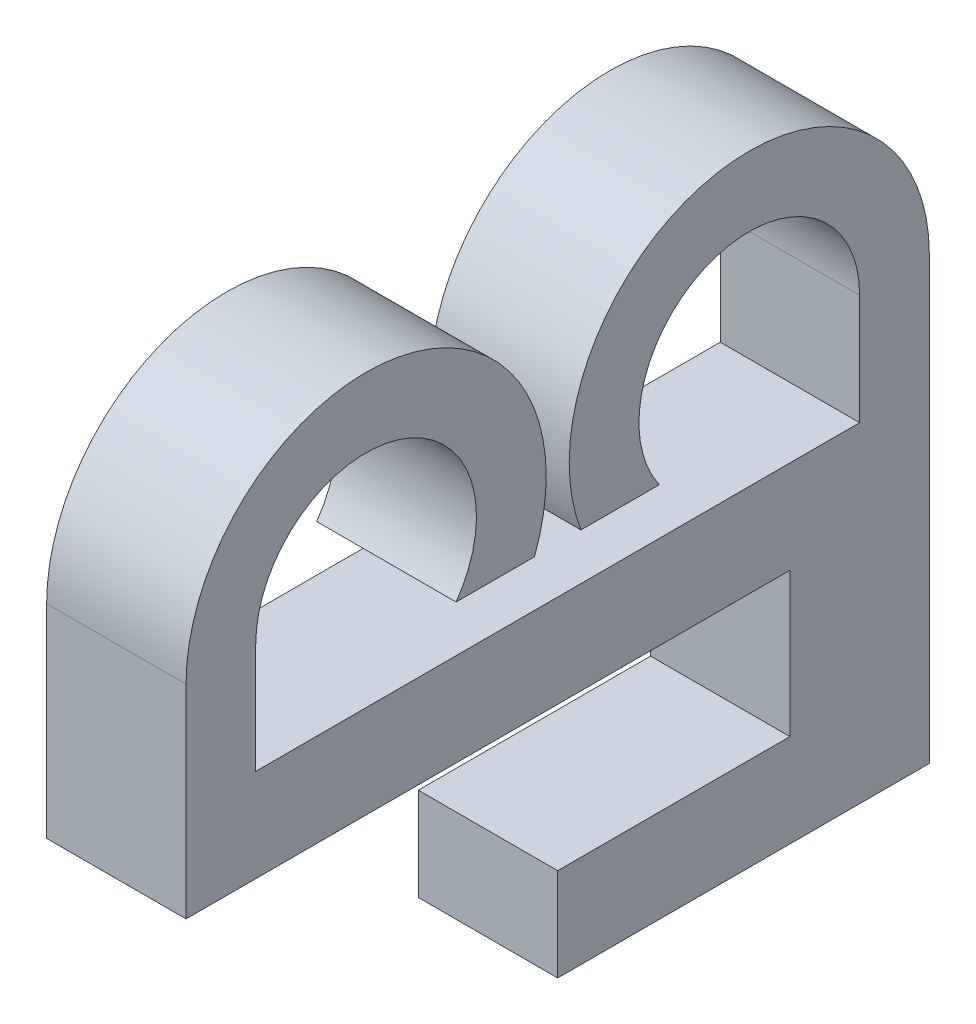
ISO-10303-21;
HEADER;
FILE_DESCRIPTION(('STEP AP214'),'2;1');
FILE_NAME('part.step','',(''),(''),'','','');
FILE_SCHEMA(('AUTOMOTIVE_DESIGN { 1 0 10303 214 1 1 1 1 }'));
ENDSEC;
DATA;
#1=APPLICATION_CONTEXT('core data for automotive mechanical design processes');
#2=APPLICATION_PROTOCOL_DEFINITION('international standard','automotive_design',2000,#1);
#3=PRODUCT_CONTEXT('',#1,'mechanical');
#4=PRODUCT('Part','Part','',(#3));
#5=PRODUCT_RELATED_PRODUCT_CATEGORY('part','',(#4));
#6=PRODUCT_DEFINITION_FORMATION('','',#4);
#7=PRODUCT_DEFINITION_CONTEXT('part definition',#1,'design');
#8=PRODUCT_DEFINITION('design','',#6,#7);
#9=PRODUCT_DEFINITION_SHAPE('','',#8);
#10=(LENGTH_UNIT() NAMED_UNIT(*) SI_UNIT(.MILLI.,.METRE.));
#11=(NAMED_UNIT(*) PLANE_ANGLE_UNIT() SI_UNIT($,.RADIAN.));
#12=(NAMED_UNIT(*) SI_UNIT($,.STERADIAN.) SOLID_ANGLE_UNIT());
#13=UNCERTAINTY_MEASURE_WITH_UNIT(LENGTH_MEASURE(1.E-05),#10,'distance_accuracy_value','');
#14=(GEOMETRIC_REPRESENTATION_CONTEXT(3) GLOBAL_UNCERTAINTY_ASSIGNED_CONTEXT((#13)) GLOBAL_UNIT_ASSIGNED_CONTEXT((#10,
#11,#12)) REPRESENTATION_CONTEXT('',''));
#15=CARTESIAN_POINT('',(0.,0.,0.));
#16=DIRECTION('',(0.,0.,1.));
#17=DIRECTION('',(1.,0.,0.));
#18=AXIS2_PLACEMENT_3D('',#15,#16,#17);
#19=CARTESIAN_POINT('',(3.,-2.,0.));
#20=DIRECTION('',(0.,1.,0.));
#21=DIRECTION('',(0.,0.,1.));
#22=AXIS2_PLACEMENT_3D('',#19,#20,#21);
#23=PLANE('',#22);
#24=DIRECTION('',(-1.,0.,0.));
#25=VECTOR('',#24,1.);
#26=CARTESIAN_POINT('',(12.4855422423965,-2.,-4.99784418654736));
#27=LINE('',#26,#25);
#28=CARTESIAN_POINT('',(3.,-2.,-4.99784418654736));
#29=VERTEX_POINT('',#28);
#30=CARTESIAN_POINT('',(0.,-2.,-4.99784418654736));
#31=VERTEX_POINT('',#30);
#32=EDGE_CURVE('E50',#29,#31,#27,.T.);
#33=ORIENTED_EDGE('',*,*,#32,.F.);
#34=DIRECTION('',(0.,0.,-1.));
#35=VECTOR('',#34,1.);
#36=CARTESIAN_POINT('',(3.,-2.,0.));
#37=LINE('',#36,#35);
#38=CARTESIAN_POINT('',(3.,-2.,7.99784418654736));
#39=VERTEX_POINT('',#38);
#40=EDGE_CURVE('E251',#39,#29,#37,.T.);
#41=ORIENTED_EDGE('',*,*,#40,.F.);
#42=DIRECTION('',(-1.,0.,0.));
#43=VECTOR('',#42,1.);
#44=CARTESIAN_POINT('',(3.,-2.,7.99784418654736));
#45=LINE('',#44,#43);
#46=CARTESIAN_POINT('',(0.,-2.,7.99784418654736));
#47=VERTEX_POINT('',#46);
#48=EDGE_CURVE('E203',#39,#47,#45,.T.);
#49=ORIENTED_EDGE('',*,*,#48,.T.);
#50=DIRECTION('',(0.,0.,-1.));
#51=VECTOR('',#50,1.);
#52=CARTESIAN_POINT('',(0.,-2.,0.));
#53=LINE('',#52,#51);
#54=EDGE_CURVE('E170',#47,#31,#53,.T.);
#55=ORIENTED_EDGE('',*,*,#54,.T.);
#56=EDGE_LOOP('',(#33,#41,#49,#55));
#57=FACE_BOUND('',#56,.T.);
#58=ADVANCED_FACE('F35',(#57),#23,.F.);
#59=CARTESIAN_POINT('',(3.,1.,0.));
#60=DIRECTION('',(0.,1.,0.));
#61=DIRECTION('',(0.,0.,1.));
#62=AXIS2_PLACEMENT_3D('',#59,#60,#61);
#63=PLANE('',#62);
#64=DIRECTION('',(0.,0.,-1.));
#65=VECTOR('',#64,1.);
#66=CARTESIAN_POINT('',(0.,1.,0.));
#67=LINE('',#66,#65);
#68=CARTESIAN_POINT('',(0.,1.,2.18635251344365));
#69=VERTEX_POINT('',#68);
#70=CARTESIAN_POINT('',(0.,1.,0.499999999999999));
#71=VERTEX_POINT('',#70);
#72=EDGE_CURVE('E163',#69,#71,#67,.T.);
#73=ORIENTED_EDGE('',*,*,#72,.T.);
#74=DIRECTION('',(-1.,0.,0.));
#75=VECTOR('',#74,1.);
#76=CARTESIAN_POINT('',(3.,1.,0.499999999999999));
#77=LINE('',#76,#75);
#78=CARTESIAN_POINT('',(3.,1.,0.499999999999999));
#79=VERTEX_POINT('',#78);
#80=EDGE_CURVE('E11',#79,#71,#77,.T.);
#81=ORIENTED_EDGE('',*,*,#80,.F.);
#82=DIRECTION('',(0.,0.,-1.));
#83=VECTOR('',#82,1.);
#84=CARTESIAN_POINT('',(3.,1.,0.));
#85=LINE('',#84,#83);
#86=CARTESIAN_POINT('',(3.,1.,2.18635251344365));
#87=VERTEX_POINT('',#86);
#88=EDGE_CURVE('E188',#87,#79,#85,.T.);
#89=ORIENTED_EDGE('',*,*,#88,.F.);
#90=DIRECTION('',(-1.,0.,0.));
#91=VECTOR('',#90,1.);
#92=CARTESIAN_POINT('',(3.,1.,2.18635251344365));
#93=LINE('',#92,#91);
#94=EDGE_CURVE('E162',#87,#69,#93,.T.);
#95=ORIENTED_EDGE('',*,*,#94,.T.);
#96=EDGE_LOOP('',(#73,#81,#89,#95));
#97=FACE_BOUND('',#96,.T.);
#98=ADVANCED_FACE('F37',(#97),#63,.F.);
#99=CARTESIAN_POINT('',(3.,2.375,4.12284418654736));
#100=DIRECTION('',(-1.,0.,0.));
#101=DIRECTION('',(0.,0.,1.));
#102=AXIS2_PLACEMENT_3D('',#99,#100,#101);
#103=CYLINDRICAL_SURFACE('',#102,3.875);
#104=CARTESIAN_POINT('',(0.,2.375,4.12284418654736));
#105=DIRECTION('',(1.,0.,0.));
#106=DIRECTION('',(0.,0.,-1.));
#107=AXIS2_PLACEMENT_3D('',#104,#105,#106);
#108=CIRCLE('',#107,3.875);
#109=CARTESIAN_POINT('',(0.,2.375,7.99784418654736));
#110=VERTEX_POINT('',#109);
#111=EDGE_CURVE('E166',#71,#110,#108,.T.);
#112=ORIENTED_EDGE('',*,*,#111,.T.);
#113=DIRECTION('',(-1.,0.,0.));
#114=VECTOR('',#113,1.);
#115=CARTESIAN_POINT('',(3.,2.375,7.99784418654736));
#116=LINE('',#115,#114);
#117=CARTESIAN_POINT('',(3.,2.375,7.99784418654736));
#118=VERTEX_POINT('',#117);
#119=EDGE_CURVE('E43',#118,#110,#116,.T.);
#120=ORIENTED_EDGE('',*,*,#119,.F.);
#121=CARTESIAN_POINT('',(3.,2.375,4.12284418654736));
#122=DIRECTION('',(1.,0.,0.));
#123=DIRECTION('',(0.,0.,-1.));
#124=AXIS2_PLACEMENT_3D('',#121,#122,#123);
#125=CIRCLE('',#124,3.875);
#126=EDGE_CURVE('E109',#79,#118,#125,.T.);
#127=ORIENTED_EDGE('',*,*,#126,.F.);
#128=ORIENTED_EDGE('',*,*,#80,.T.);
#129=EDGE_LOOP('',(#112,#120,#127,#128));
#130=FACE_BOUND('',#129,.T.);
#131=ADVANCED_FACE('F329',(#130),#103,.T.);
#132=CARTESIAN_POINT('',(3.,0.,7.99784418654736));
#133=DIRECTION('',(0.,0.,-1.));
#134=DIRECTION('',(-1.,0.,0.));
#135=AXIS2_PLACEMENT_3D('',#132,#133,#134);
#136=PLANE('',#135);
#137=DIRECTION('',(0.,-1.,0.));
#138=VECTOR('',#137,1.);
#139=CARTESIAN_POINT('',(0.,0.,7.99784418654736));
#140=LINE('',#139,#138);
#141=EDGE_CURVE('E168',#110,#47,#140,.T.);
#142=ORIENTED_EDGE('',*,*,#141,.T.);
#143=ORIENTED_EDGE('',*,*,#48,.F.);
#144=DIRECTION('',(0.,-1.,0.));
#145=VECTOR('',#144,1.);
#146=CARTESIAN_POINT('',(3.,0.,7.99784418654736));
#147=LINE('',#146,#145);
#148=EDGE_CURVE('E211',#118,#39,#147,.T.);
#149=ORIENTED_EDGE('',*,*,#148,.F.);
#150=ORIENTED_EDGE('',*,*,#119,.T.);
#151=EDGE_LOOP('',(#142,#143,#149,#150));
#152=FACE_BOUND('',#151,.T.);
#153=ADVANCED_FACE('F209',(#152),#136,.F.);
#154=CARTESIAN_POINT('',(3.,0.,-7.99784418654736));
#155=DIRECTION('',(0.,0.,-1.));
#156=DIRECTION('',(0.,1.,0.));
#157=AXIS2_PLACEMENT_3D('',#154,#155,#156);
#158=PLANE('',#157);
#159=DIRECTION('',(0.,-1.,0.));
#160=VECTOR('',#159,1.);
#161=CARTESIAN_POINT('',(0.,0.,-7.99784418654736));
#162=LINE('',#161,#160);
#163=CARTESIAN_POINT('',(0.,2.375,-7.99784418654736));
#164=VERTEX_POINT('',#163);
#165=CARTESIAN_POINT('',(0.,-7.1,-7.99784418654736));
#166=VERTEX_POINT('',#165);
#167=EDGE_CURVE('E172',#164,#166,#162,.T.);
#168=ORIENTED_EDGE('',*,*,#167,.F.);
#169=DIRECTION('',(-1.,0.,0.));
#170=VECTOR('',#169,1.);
#171=CARTESIAN_POINT('',(3.,2.375,-7.99784418654736));
#172=LINE('',#171,#170);
#173=CARTESIAN_POINT('',(3.,2.375,-7.99784418654736));
#174=VERTEX_POINT('',#173);
#175=EDGE_CURVE('E201',#174,#164,#172,.T.);
#176=ORIENTED_EDGE('',*,*,#175,.F.);
#177=DIRECTION('',(0.,-1.,0.));
#178=VECTOR('',#177,1.);
#179=CARTESIAN_POINT('',(3.,0.,-7.99784418654736));
#180=LINE('',#179,#178);
#181=CARTESIAN_POINT('',(3.,-7.1,-7.99784418654736));
#182=VERTEX_POINT('',#181);
#183=EDGE_CURVE('E253',#174,#182,#180,.T.);
#184=ORIENTED_EDGE('',*,*,#183,.T.);
#185=DIRECTION('',(-1.,0.,0.));
#186=VECTOR('',#185,1.);
#187=CARTESIAN_POINT('',(12.4855422423965,-7.1,-7.99784418654736));
#188=LINE('',#187,#186);
#189=EDGE_CURVE('E245',#182,#166,#188,.T.);
#190=ORIENTED_EDGE('',*,*,#189,.T.);
#191=EDGE_LOOP('',(#168,#176,#184,#190));
#192=FACE_BOUND('',#191,.T.);
#193=ADVANCED_FACE('F318',(#192),#158,.T.);
#194=CARTESIAN_POINT('',(3.,2.375,-4.12284418654736));
#195=DIRECTION('',(-1.,0.,0.));
#196=DIRECTION('',(0.,0.,1.));
#197=AXIS2_PLACEMENT_3D('',#194,#195,#196);
#198=CYLINDRICAL_SURFACE('',#197,3.875);
#199=CARTESIAN_POINT('',(0.,2.375,-4.12284418654736));
#200=DIRECTION('',(1.,0.,0.));
#201=DIRECTION('',(0.,0.,-1.));
#202=AXIS2_PLACEMENT_3D('',#199,#200,#201);
#203=CIRCLE('',#202,3.875);
#204=CARTESIAN_POINT('',(0.,1.,-0.500000000000001));
#205=VERTEX_POINT('',#204);
#206=EDGE_CURVE('E175',#164,#205,#203,.T.);
#207=ORIENTED_EDGE('',*,*,#206,.T.);
#208=DIRECTION('',(-1.,0.,0.));
#209=VECTOR('',#208,1.);
#210=CARTESIAN_POINT('',(3.,1.,-0.500000000000001));
#211=LINE('',#210,#209);
#212=CARTESIAN_POINT('',(3.,1.,-0.500000000000001));
#213=VERTEX_POINT('',#212);
#214=EDGE_CURVE('E198',#213,#205,#211,.T.);
#215=ORIENTED_EDGE('',*,*,#214,.F.);
#216=CARTESIAN_POINT('',(3.,2.375,-4.12284418654736));
#217=DIRECTION('',(1.,0.,0.));
#218=DIRECTION('',(0.,0.,-1.));
#219=AXIS2_PLACEMENT_3D('',#216,#217,#218);
#220=CIRCLE('',#219,3.875);
#221=EDGE_CURVE('E256',#174,#213,#220,.T.);
#222=ORIENTED_EDGE('',*,*,#221,.F.);
#223=ORIENTED_EDGE('',*,*,#175,.T.);
#224=EDGE_LOOP('',(#207,#215,#222,#223));
#225=FACE_BOUND('',#224,.T.);
#226=ADVANCED_FACE('F320',(#225),#198,.T.);
#227=CARTESIAN_POINT('',(3.,1.,0.));
#228=DIRECTION('',(0.,1.,0.));
#229=DIRECTION('',(0.,0.,1.));
#230=AXIS2_PLACEMENT_3D('',#227,#228,#229);
#231=PLANE('',#230);
#232=DIRECTION('',(0.,0.,-1.));
#233=VECTOR('',#232,1.);
#234=CARTESIAN_POINT('',(0.,1.,0.));
#235=LINE('',#234,#233);
#236=CARTESIAN_POINT('',(0.,1.,-2.18635251344365));
#237=VERTEX_POINT('',#236);
#238=EDGE_CURVE('E177',#205,#237,#235,.T.);
#239=ORIENTED_EDGE('',*,*,#238,.T.);
#240=DIRECTION('',(-1.,0.,0.));
#241=VECTOR('',#240,1.);
#242=CARTESIAN_POINT('',(3.,1.,-2.18635251344365));
#243=LINE('',#242,#241);
#244=CARTESIAN_POINT('',(3.,1.,-2.18635251344365));
#245=VERTEX_POINT('',#244);
#246=EDGE_CURVE('E195',#245,#237,#243,.T.);
#247=ORIENTED_EDGE('',*,*,#246,.F.);
#248=DIRECTION('',(0.,0.,-1.));
#249=VECTOR('',#248,1.);
#250=CARTESIAN_POINT('',(3.,1.,0.));
#251=LINE('',#250,#249);
#252=EDGE_CURVE('E258',#213,#245,#251,.T.);
#253=ORIENTED_EDGE('',*,*,#252,.F.);
#254=ORIENTED_EDGE('',*,*,#214,.T.);
#255=EDGE_LOOP('',(#239,#247,#253,#254));
#256=FACE_BOUND('',#255,.T.);
#257=ADVANCED_FACE('F326',(#256),#231,.F.);
#258=CARTESIAN_POINT('',(3.,2.375,-4.12284418654736));
#259=DIRECTION('',(-1.,0.,0.));
#260=DIRECTION('',(0.,0.,1.));
#261=AXIS2_PLACEMENT_3D('',#258,#259,#260);
#262=CYLINDRICAL_SURFACE('',#261,2.375);
#263=CARTESIAN_POINT('',(0.,2.375,-4.12284418654736));
#264=DIRECTION('',(1.,0.,0.));
#265=DIRECTION('',(0.,0.,-1.));
#266=AXIS2_PLACEMENT_3D('',#263,#264,#265);
#267=CIRCLE('',#266,2.375);
#268=CARTESIAN_POINT('',(0.,2.375,-6.49784418654736));
#269=VERTEX_POINT('',#268);
#270=EDGE_CURVE('E179',#237,#269,#267,.F.);
#271=ORIENTED_EDGE('',*,*,#270,.T.);
#272=DIRECTION('',(-1.,0.,0.));
#273=VECTOR('',#272,1.);
#274=CARTESIAN_POINT('',(3.,2.375,-6.49784418654736));
#275=LINE('',#274,#273);
#276=CARTESIAN_POINT('',(3.,2.375,-6.49784418654736));
#277=VERTEX_POINT('',#276);
#278=EDGE_CURVE('E192',#277,#269,#275,.T.);
#279=ORIENTED_EDGE('',*,*,#278,.F.);
#280=CARTESIAN_POINT('',(3.,2.375,-4.12284418654736));
#281=DIRECTION('',(1.,0.,0.));
#282=DIRECTION('',(0.,0.,-1.));
#283=AXIS2_PLACEMENT_3D('',#280,#281,#282);
#284=CIRCLE('',#283,2.375);
#285=EDGE_CURVE('E157',#245,#277,#284,.F.);
#286=ORIENTED_EDGE('',*,*,#285,.F.);
#287=ORIENTED_EDGE('',*,*,#246,.T.);
#288=EDGE_LOOP('',(#271,#279,#286,#287));
#289=FACE_BOUND('',#288,.T.);
#290=ADVANCED_FACE('F264',(#289),#262,.F.);
#291=CARTESIAN_POINT('',(3.,0.,-6.49784418654736));
#292=DIRECTION('',(0.,0.,-1.));
#293=DIRECTION('',(0.,1.,0.));
#294=AXIS2_PLACEMENT_3D('',#291,#292,#293);
#295=PLANE('',#294);
#296=DIRECTION('',(0.,-1.,0.));
#297=VECTOR('',#296,1.);
#298=CARTESIAN_POINT('',(0.,0.,-6.49784418654736));
#299=LINE('',#298,#297);
#300=CARTESIAN_POINT('',(0.,0.,-6.49784418654736));
#301=VERTEX_POINT('',#300);
#302=EDGE_CURVE('E181',#269,#301,#299,.T.);
#303=ORIENTED_EDGE('',*,*,#302,.T.);
#304=DIRECTION('',(-1.,0.,0.));
#305=VECTOR('',#304,1.);
#306=CARTESIAN_POINT('',(3.,0.,-6.49784418654736));
#307=LINE('',#306,#305);
#308=CARTESIAN_POINT('',(3.,0.,-6.49784418654736));
#309=VERTEX_POINT('',#308);
#310=EDGE_CURVE('E145',#309,#301,#307,.T.);
#311=ORIENTED_EDGE('',*,*,#310,.F.);
#312=DIRECTION('',(0.,-1.,0.));
#313=VECTOR('',#312,1.);
#314=CARTESIAN_POINT('',(3.,0.,-6.49784418654736));
#315=LINE('',#314,#313);
#316=EDGE_CURVE('E154',#277,#309,#315,.T.);
#317=ORIENTED_EDGE('',*,*,#316,.F.);
#318=ORIENTED_EDGE('',*,*,#278,.T.);
#319=EDGE_LOOP('',(#303,#311,#317,#318));
#320=FACE_BOUND('',#319,.T.);
#321=ADVANCED_FACE('F268',(#320),#295,.F.);
#322=CARTESIAN_POINT('',(3.,0.,0.));
#323=DIRECTION('',(0.,1.,0.));
#324=DIRECTION('',(0.,0.,1.));
#325=AXIS2_PLACEMENT_3D('',#322,#323,#324);
#326=PLANE('',#325);
#327=DIRECTION('',(0.,0.,-1.));
#328=VECTOR('',#327,1.);
#329=CARTESIAN_POINT('',(0.,0.,0.));
#330=LINE('',#329,#328);
#331=CARTESIAN_POINT('',(0.,0.,6.49784418654736));
#332=VERTEX_POINT('',#331);
#333=EDGE_CURVE('E142',#332,#301,#330,.T.);
#334=ORIENTED_EDGE('',*,*,#333,.F.);
#335=DIRECTION('',(-1.,0.,0.));
#336=VECTOR('',#335,1.);
#337=CARTESIAN_POINT('',(3.,0.,6.49784418654736));
#338=LINE('',#337,#336);
#339=CARTESIAN_POINT('',(3.,0.,6.49784418654736));
#340=VERTEX_POINT('',#339);
#341=EDGE_CURVE('E136',#340,#332,#338,.T.);
#342=ORIENTED_EDGE('',*,*,#341,.F.);
#343=DIRECTION('',(0.,0.,-1.));
#344=VECTOR('',#343,1.);
#345=CARTESIAN_POINT('',(3.,0.,0.));
#346=LINE('',#345,#344);
#347=EDGE_CURVE('E140',#340,#309,#346,.T.);
#348=ORIENTED_EDGE('',*,*,#347,.T.);
#349=ORIENTED_EDGE('',*,*,#310,.T.);
#350=EDGE_LOOP('',(#334,#342,#348,#349));
#351=FACE_BOUND('',#350,.T.);
#352=ADVANCED_FACE('F138',(#351),#326,.T.);
#353=CARTESIAN_POINT('',(3.,0.,6.49784418654736));
#354=DIRECTION('',(0.,0.,1.));
#355=DIRECTION('',(1.,0.,0.));
#356=AXIS2_PLACEMENT_3D('',#353,#354,#355);
#357=PLANE('',#356);
#358=DIRECTION('',(0.,1.,0.));
#359=VECTOR('',#358,1.);
#360=CARTESIAN_POINT('',(0.,0.,6.49784418654736));
#361=LINE('',#360,#359);
#362=CARTESIAN_POINT('',(0.,2.375,6.49784418654736));
#363=VERTEX_POINT('',#362);
#364=EDGE_CURVE('E185',#332,#363,#361,.T.);
#365=ORIENTED_EDGE('',*,*,#364,.T.);
#366=DIRECTION('',(-1.,0.,0.));
#367=VECTOR('',#366,1.);
#368=CARTESIAN_POINT('',(3.,2.375,6.49784418654736));
#369=LINE('',#368,#367);
#370=CARTESIAN_POINT('',(3.,2.375,6.49784418654736));
#371=VERTEX_POINT('',#370);
#372=EDGE_CURVE('E146',#371,#363,#369,.T.);
#373=ORIENTED_EDGE('',*,*,#372,.F.);
#374=DIRECTION('',(0.,1.,0.));
#375=VECTOR('',#374,1.);
#376=CARTESIAN_POINT('',(3.,0.,6.49784418654736));
#377=LINE('',#376,#375);
#378=EDGE_CURVE('E149',#340,#371,#377,.T.);
#379=ORIENTED_EDGE('',*,*,#378,.F.);
#380=ORIENTED_EDGE('',*,*,#341,.T.);
#381=EDGE_LOOP('',(#365,#373,#379,#380));
#382=FACE_BOUND('',#381,.T.);
#383=ADVANCED_FACE('F150',(#382),#357,.F.);
#384=CARTESIAN_POINT('',(3.,2.375,4.12284418654736));
#385=DIRECTION('',(-1.,0.,0.));
#386=DIRECTION('',(0.,0.,1.));
#387=AXIS2_PLACEMENT_3D('',#384,#385,#386);
#388=CYLINDRICAL_SURFACE('',#387,2.375);
#389=CARTESIAN_POINT('',(0.,2.375,4.12284418654736));
#390=DIRECTION('',(1.,0.,0.));
#391=DIRECTION('',(0.,0.,-1.));
#392=AXIS2_PLACEMENT_3D('',#389,#390,#391);
#393=CIRCLE('',#392,2.375);
#394=EDGE_CURVE('E101',#363,#69,#393,.F.);
#395=ORIENTED_EDGE('',*,*,#394,.T.);
#396=ORIENTED_EDGE('',*,*,#94,.F.);
#397=CARTESIAN_POINT('',(3.,2.375,4.12284418654736));
#398=DIRECTION('',(1.,0.,0.));
#399=DIRECTION('',(0.,0.,-1.));
#400=AXIS2_PLACEMENT_3D('',#397,#398,#399);
#401=CIRCLE('',#400,2.375);
#402=EDGE_CURVE('E59',#371,#87,#401,.F.);
#403=ORIENTED_EDGE('',*,*,#402,.F.);
#404=ORIENTED_EDGE('',*,*,#372,.T.);
#405=EDGE_LOOP('',(#395,#396,#403,#404));
#406=FACE_BOUND('',#405,.T.);
#407=ADVANCED_FACE('F269',(#406),#388,.F.);
#408=CARTESIAN_POINT('',(3.,0.,0.));
#409=DIRECTION('',(1.,0.,0.));
#410=DIRECTION('',(0.,0.,-1.));
#411=AXIS2_PLACEMENT_3D('',#408,#409,#410);
#412=PLANE('',#411);
#413=ORIENTED_EDGE('',*,*,#88,.T.);
#414=ORIENTED_EDGE('',*,*,#126,.T.);
#415=ORIENTED_EDGE('',*,*,#148,.T.);
#416=ORIENTED_EDGE('',*,*,#40,.T.);
#417=DIRECTION('',(0.,1.,0.));
#418=VECTOR('',#417,1.);
#419=CARTESIAN_POINT('',(3.,-5.1,-4.99784418654736));
#420=LINE('',#419,#418);
#421=CARTESIAN_POINT('',(3.,-5.1,-4.99784418654736));
#422=VERTEX_POINT('',#421);
#423=EDGE_CURVE('E227',#422,#29,#420,.T.);
#424=ORIENTED_EDGE('',*,*,#423,.F.);
#425=DIRECTION('',(0.,0.,-1.));
#426=VECTOR('',#425,1.);
#427=CARTESIAN_POINT('',(3.,-5.1,0.));
#428=LINE('',#427,#426);
#429=CARTESIAN_POINT('',(3.,-5.1,0.));
#430=VERTEX_POINT('',#429);
#431=EDGE_CURVE('E237',#430,#422,#428,.T.);
#432=ORIENTED_EDGE('',*,*,#431,.F.);
#433=DIRECTION('',(0.,1.,0.));
#434=VECTOR('',#433,1.);
#435=CARTESIAN_POINT('',(3.,-7.1,0.));
#436=LINE('',#435,#434);
#437=CARTESIAN_POINT('',(3.,-7.1,0.));
#438=VERTEX_POINT('',#437);
#439=EDGE_CURVE('E241',#438,#430,#436,.T.);
#440=ORIENTED_EDGE('',*,*,#439,.F.);
#441=DIRECTION('',(0.,0.,1.));
#442=VECTOR('',#441,1.);
#443=CARTESIAN_POINT('',(3.,-7.1,-7.99784418654736));
#444=LINE('',#443,#442);
#445=EDGE_CURVE('E233',#182,#438,#444,.T.);
#446=ORIENTED_EDGE('',*,*,#445,.F.);
#447=ORIENTED_EDGE('',*,*,#183,.F.);
#448=ORIENTED_EDGE('',*,*,#221,.T.);
#449=ORIENTED_EDGE('',*,*,#252,.T.);
#450=ORIENTED_EDGE('',*,*,#285,.T.);
#451=ORIENTED_EDGE('',*,*,#316,.T.);
#452=ORIENTED_EDGE('',*,*,#347,.F.);
#453=ORIENTED_EDGE('',*,*,#378,.T.);
#454=ORIENTED_EDGE('',*,*,#402,.T.);
#455=EDGE_LOOP('',(#413,#414,#415,#416,#424,#432,#440,#446,#447,#448,#449,#450,#451,#452,#453,#454));
#456=FACE_BOUND('',#455,.T.);
#457=ADVANCED_FACE('F152',(#456),#412,.T.);
#458=CARTESIAN_POINT('',(0.,0.,0.));
#459=DIRECTION('',(1.,0.,0.));
#460=DIRECTION('',(0.,0.,-1.));
#461=AXIS2_PLACEMENT_3D('',#458,#459,#460);
#462=PLANE('',#461);
#463=ORIENTED_EDGE('',*,*,#72,.F.);
#464=ORIENTED_EDGE('',*,*,#394,.F.);
#465=ORIENTED_EDGE('',*,*,#364,.F.);
#466=ORIENTED_EDGE('',*,*,#333,.T.);
#467=ORIENTED_EDGE('',*,*,#302,.F.);
#468=ORIENTED_EDGE('',*,*,#270,.F.);
#469=ORIENTED_EDGE('',*,*,#238,.F.);
#470=ORIENTED_EDGE('',*,*,#206,.F.);
#471=ORIENTED_EDGE('',*,*,#167,.T.);
#472=DIRECTION('',(0.,0.,1.));
#473=VECTOR('',#472,1.);
#474=CARTESIAN_POINT('',(0.,-7.1,-7.99784418654736));
#475=LINE('',#474,#473);
#476=CARTESIAN_POINT('',(0.,-7.1,0.));
#477=VERTEX_POINT('',#476);
#478=EDGE_CURVE('E308',#166,#477,#475,.T.);
#479=ORIENTED_EDGE('',*,*,#478,.T.);
#480=DIRECTION('',(0.,1.,0.));
#481=VECTOR('',#480,1.);
#482=CARTESIAN_POINT('',(0.,-7.1,0.));
#483=LINE('',#482,#481);
#484=CARTESIAN_POINT('',(0.,-5.1,0.));
#485=VERTEX_POINT('',#484);
#486=EDGE_CURVE('E310',#477,#485,#483,.T.);
#487=ORIENTED_EDGE('',*,*,#486,.T.);
#488=DIRECTION('',(0.,0.,-1.));
#489=VECTOR('',#488,1.);
#490=CARTESIAN_POINT('',(0.,-5.1,0.));
#491=LINE('',#490,#489);
#492=CARTESIAN_POINT('',(0.,-5.1,-4.99784418654736));
#493=VERTEX_POINT('',#492);
#494=EDGE_CURVE('E311',#485,#493,#491,.T.);
#495=ORIENTED_EDGE('',*,*,#494,.T.);
#496=DIRECTION('',(0.,1.,0.));
#497=VECTOR('',#496,1.);
#498=CARTESIAN_POINT('',(0.,-5.1,-4.99784418654736));
#499=LINE('',#498,#497);
#500=EDGE_CURVE('E219',#493,#31,#499,.T.);
#501=ORIENTED_EDGE('',*,*,#500,.T.);
#502=ORIENTED_EDGE('',*,*,#54,.F.);
#503=ORIENTED_EDGE('',*,*,#141,.F.);
#504=ORIENTED_EDGE('',*,*,#111,.F.);
#505=EDGE_LOOP('',(#463,#464,#465,#466,#467,#468,#469,#470,#471,#479,#487,#495,#501,#502,#503,#504));
#506=FACE_BOUND('',#505,.T.);
#507=ADVANCED_FACE('F215',(#506),#462,.F.);
#508=CARTESIAN_POINT('',(12.4855422423965,-7.1,-7.99784418654736));
#509=DIRECTION('',(0.,-1.,0.));
#510=DIRECTION('',(0.,0.,-1.));
#511=AXIS2_PLACEMENT_3D('',#508,#509,#510);
#512=PLANE('',#511);
#513=ORIENTED_EDGE('',*,*,#189,.F.);
#514=ORIENTED_EDGE('',*,*,#445,.T.);
#515=DIRECTION('',(-1.,0.,0.));
#516=VECTOR('',#515,1.);
#517=CARTESIAN_POINT('',(12.4855422423965,-7.1,0.));
#518=LINE('',#517,#516);
#519=EDGE_CURVE('E242',#438,#477,#518,.T.);
#520=ORIENTED_EDGE('',*,*,#519,.T.);
#521=ORIENTED_EDGE('',*,*,#478,.F.);
#522=EDGE_LOOP('',(#513,#514,#520,#521));
#523=FACE_BOUND('',#522,.T.);
#524=ADVANCED_FACE('F306',(#523),#512,.T.);
#525=CARTESIAN_POINT('',(12.4855422423965,-7.1,0.));
#526=DIRECTION('',(0.,0.,1.));
#527=DIRECTION('',(1.,0.,0.));
#528=AXIS2_PLACEMENT_3D('',#525,#526,#527);
#529=PLANE('',#528);
#530=ORIENTED_EDGE('',*,*,#519,.F.);
#531=ORIENTED_EDGE('',*,*,#439,.T.);
#532=DIRECTION('',(-1.,0.,0.));
#533=VECTOR('',#532,1.);
#534=CARTESIAN_POINT('',(12.4855422423965,-5.1,0.));
#535=LINE('',#534,#533);
#536=EDGE_CURVE('E238',#430,#485,#535,.T.);
#537=ORIENTED_EDGE('',*,*,#536,.T.);
#538=ORIENTED_EDGE('',*,*,#486,.F.);
#539=EDGE_LOOP('',(#530,#531,#537,#538));
#540=FACE_BOUND('',#539,.T.);
#541=ADVANCED_FACE('F288',(#540),#529,.T.);
#542=CARTESIAN_POINT('',(12.4855422423965,-5.1,0.));
#543=DIRECTION('',(0.,1.,0.));
#544=DIRECTION('',(0.,0.,1.));
#545=AXIS2_PLACEMENT_3D('',#542,#543,#544);
#546=PLANE('',#545);
#547=ORIENTED_EDGE('',*,*,#536,.F.);
#548=ORIENTED_EDGE('',*,*,#431,.T.);
#549=DIRECTION('',(-1.,0.,0.));
#550=VECTOR('',#549,1.);
#551=CARTESIAN_POINT('',(12.4855422423965,-5.1,-4.99784418654736));
#552=LINE('',#551,#550);
#553=EDGE_CURVE('E229',#422,#493,#552,.T.);
#554=ORIENTED_EDGE('',*,*,#553,.T.);
#555=ORIENTED_EDGE('',*,*,#494,.F.);
#556=EDGE_LOOP('',(#547,#548,#554,#555));
#557=FACE_BOUND('',#556,.T.);
#558=ADVANCED_FACE('F282',(#557),#546,.T.);
#559=CARTESIAN_POINT('',(12.4855422423965,-5.1,-4.99784418654736));
#560=DIRECTION('',(0.,0.,1.));
#561=DIRECTION('',(1.,0.,0.));
#562=AXIS2_PLACEMENT_3D('',#559,#560,#561);
#563=PLANE('',#562);
#564=ORIENTED_EDGE('',*,*,#553,.F.);
#565=ORIENTED_EDGE('',*,*,#423,.T.);
#566=ORIENTED_EDGE('',*,*,#32,.T.);
#567=ORIENTED_EDGE('',*,*,#500,.F.);
#568=EDGE_LOOP('',(#564,#565,#566,#567));
#569=FACE_BOUND('',#568,.T.);
#570=ADVANCED_FACE('F225',(#569),#563,.T.);
#571=CLOSED_SHELL('',(#58,#98,#131,#153,#193,#226,#257,#290,#321,#352,#383,#407,#457,#507,#524,
#541,#558,#570));
#572=MANIFOLD_SOLID_BREP('B2',#571);
#573=ADVANCED_BREP_SHAPE_REPRESENTATION('',(#18,#572),#14);
#574=SHAPE_DEFINITION_REPRESENTATION(#9,#573);
ENDSEC;
END-ISO-10303-21;
